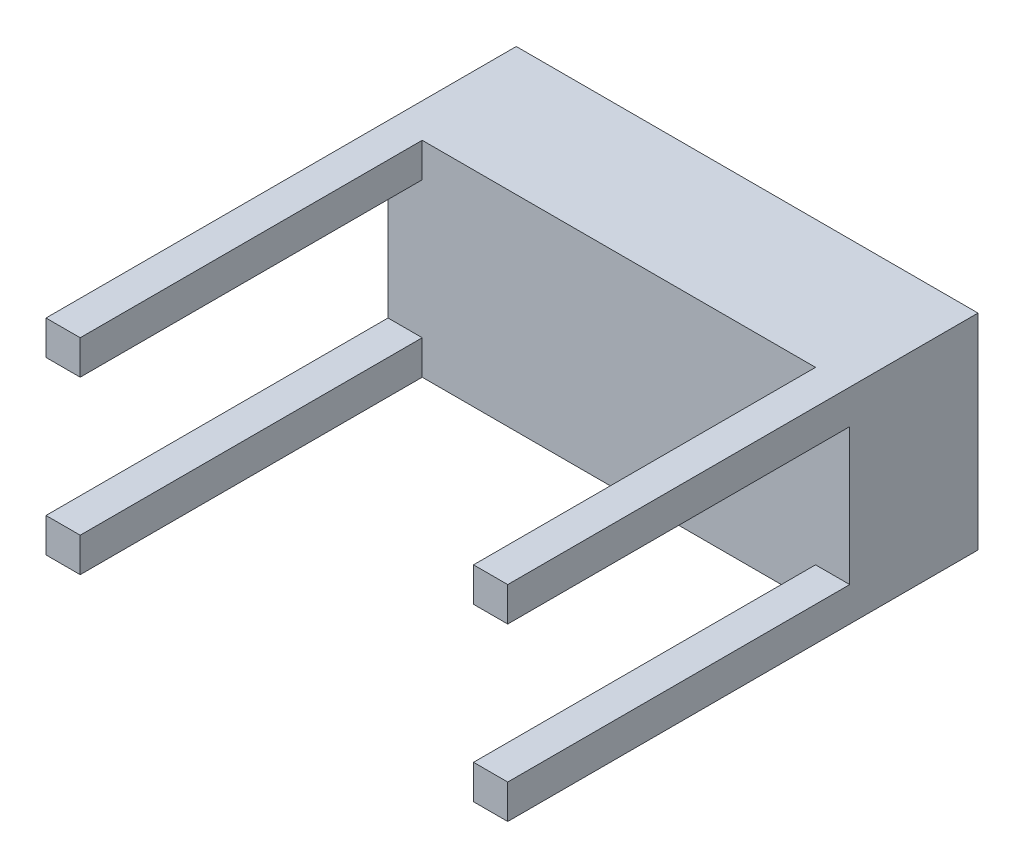
ISO-10303-21;
HEADER;
FILE_DESCRIPTION(('STEP AP214'),'2;1');
FILE_NAME('part.step','',(''),(''),'','','');
FILE_SCHEMA(('AUTOMOTIVE_DESIGN { 1 0 10303 214 1 1 1 1 }'));
ENDSEC;
DATA;
#1=APPLICATION_CONTEXT('core data for automotive mechanical design processes');
#2=APPLICATION_PROTOCOL_DEFINITION('international standard','automotive_design',2000,#1);
#3=PRODUCT_CONTEXT('',#1,'mechanical');
#4=PRODUCT('Part','Part','',(#3));
#5=PRODUCT_RELATED_PRODUCT_CATEGORY('part','',(#4));
#6=PRODUCT_DEFINITION_FORMATION('','',#4);
#7=PRODUCT_DEFINITION_CONTEXT('part definition',#1,'design');
#8=PRODUCT_DEFINITION('design','',#6,#7);
#9=PRODUCT_DEFINITION_SHAPE('','',#8);
#10=(LENGTH_UNIT() NAMED_UNIT(*) SI_UNIT(.MILLI.,.METRE.));
#11=(NAMED_UNIT(*) PLANE_ANGLE_UNIT() SI_UNIT($,.RADIAN.));
#12=(NAMED_UNIT(*) SI_UNIT($,.STERADIAN.) SOLID_ANGLE_UNIT());
#13=UNCERTAINTY_MEASURE_WITH_UNIT(LENGTH_MEASURE(1.E-05),#10,'distance_accuracy_value','');
#14=(GEOMETRIC_REPRESENTATION_CONTEXT(3) GLOBAL_UNCERTAINTY_ASSIGNED_CONTEXT((#13)) GLOBAL_UNIT_ASSIGNED_CONTEXT((#10,
#11,#12)) REPRESENTATION_CONTEXT('',''));
#15=CARTESIAN_POINT('',(0.,0.,0.));
#16=DIRECTION('',(0.,0.,1.));
#17=DIRECTION('',(1.,0.,0.));
#18=AXIS2_PLACEMENT_3D('',#15,#16,#17);
#19=CARTESIAN_POINT('',(0.,0.,150.));
#20=DIRECTION('',(0.,0.,1.));
#21=DIRECTION('',(1.,0.,0.));
#22=AXIS2_PLACEMENT_3D('',#19,#20,#21);
#23=PLANE('',#22);
#24=DIRECTION('',(1.,0.,0.));
#25=VECTOR('',#24,1.);
#26=CARTESIAN_POINT('',(0.,200.,150.));
#27=LINE('',#26,#25);
#28=CARTESIAN_POINT('',(-40.,200.,150.));
#29=VERTEX_POINT('',#28);
#30=CARTESIAN_POINT('',(0.,200.,150.));
#31=VERTEX_POINT('',#30);
#32=EDGE_CURVE('E51',#29,#31,#27,.T.);
#33=ORIENTED_EDGE('',*,*,#32,.F.);
#34=DIRECTION('',(0.,-1.,0.));
#35=VECTOR('',#34,1.);
#36=CARTESIAN_POINT('',(-40.,240.,150.));
#37=LINE('',#36,#35);
#38=CARTESIAN_POINT('',(-40.,240.,150.));
#39=VERTEX_POINT('',#38);
#40=EDGE_CURVE('E428',#39,#29,#37,.T.);
#41=ORIENTED_EDGE('',*,*,#40,.F.);
#42=DIRECTION('',(-1.,0.,0.));
#43=VECTOR('',#42,1.);
#44=CARTESIAN_POINT('',(0.,240.,150.));
#45=LINE('',#44,#43);
#46=CARTESIAN_POINT('',(-500.,240.,150.));
#47=VERTEX_POINT('',#46);
#48=EDGE_CURVE('E169',#39,#47,#45,.T.);
#49=ORIENTED_EDGE('',*,*,#48,.T.);
#50=DIRECTION('',(0.,1.,0.));
#51=VECTOR('',#50,1.);
#52=CARTESIAN_POINT('',(-500.,240.,150.));
#53=LINE('',#52,#51);
#54=CARTESIAN_POINT('',(-500.,200.,150.));
#55=VERTEX_POINT('',#54);
#56=EDGE_CURVE('E225',#55,#47,#53,.T.);
#57=ORIENTED_EDGE('',*,*,#56,.F.);
#58=DIRECTION('',(1.,0.,0.));
#59=VECTOR('',#58,1.);
#60=CARTESIAN_POINT('',(-540.,200.,150.));
#61=LINE('',#60,#59);
#62=CARTESIAN_POINT('',(-540.,200.,150.));
#63=VERTEX_POINT('',#62);
#64=EDGE_CURVE('E220',#63,#55,#61,.T.);
#65=ORIENTED_EDGE('',*,*,#64,.F.);
#66=DIRECTION('',(0.,-1.,0.));
#67=VECTOR('',#66,1.);
#68=CARTESIAN_POINT('',(-540.,0.,150.));
#69=LINE('',#68,#67);
#70=CARTESIAN_POINT('',(-540.,40.,150.));
#71=VERTEX_POINT('',#70);
#72=EDGE_CURVE('E248',#63,#71,#69,.T.);
#73=ORIENTED_EDGE('',*,*,#72,.T.);
#74=DIRECTION('',(-1.,0.,0.));
#75=VECTOR('',#74,1.);
#76=CARTESIAN_POINT('',(-540.,40.,150.));
#77=LINE('',#76,#75);
#78=CARTESIAN_POINT('',(-500.,40.,150.));
#79=VERTEX_POINT('',#78);
#80=EDGE_CURVE('E204',#79,#71,#77,.T.);
#81=ORIENTED_EDGE('',*,*,#80,.F.);
#82=DIRECTION('',(0.,1.,0.));
#83=VECTOR('',#82,1.);
#84=CARTESIAN_POINT('',(-500.,0.,150.));
#85=LINE('',#84,#83);
#86=CARTESIAN_POINT('',(-500.,0.,150.));
#87=VERTEX_POINT('',#86);
#88=EDGE_CURVE('E199',#87,#79,#85,.T.);
#89=ORIENTED_EDGE('',*,*,#88,.F.);
#90=DIRECTION('',(1.,0.,0.));
#91=VECTOR('',#90,1.);
#92=CARTESIAN_POINT('',(0.,0.,150.));
#93=LINE('',#92,#91);
#94=CARTESIAN_POINT('',(-40.,0.,150.));
#95=VERTEX_POINT('',#94);
#96=EDGE_CURVE('E251',#87,#95,#93,.T.);
#97=ORIENTED_EDGE('',*,*,#96,.T.);
#98=DIRECTION('',(0.,-1.,0.));
#99=VECTOR('',#98,1.);
#100=CARTESIAN_POINT('',(-40.,0.,150.));
#101=LINE('',#100,#99);
#102=CARTESIAN_POINT('',(-40.,40.,150.));
#103=VERTEX_POINT('',#102);
#104=EDGE_CURVE('E173',#103,#95,#101,.T.);
#105=ORIENTED_EDGE('',*,*,#104,.F.);
#106=DIRECTION('',(-1.,0.,0.));
#107=VECTOR('',#106,1.);
#108=CARTESIAN_POINT('',(0.,40.,150.));
#109=LINE('',#108,#107);
#110=CARTESIAN_POINT('',(0.,40.,150.));
#111=VERTEX_POINT('',#110);
#112=EDGE_CURVE('E170',#111,#103,#109,.T.);
#113=ORIENTED_EDGE('',*,*,#112,.F.);
#114=DIRECTION('',(0.,1.,0.));
#115=VECTOR('',#114,1.);
#116=CARTESIAN_POINT('',(0.,0.,150.));
#117=LINE('',#116,#115);
#118=EDGE_CURVE('E56',#111,#31,#117,.T.);
#119=ORIENTED_EDGE('',*,*,#118,.T.);
#120=EDGE_LOOP('',(#33,#41,#49,#57,#65,#73,#81,#89,#97,#105,#113,#119));
#121=FACE_BOUND('',#120,.T.);
#122=ADVANCED_FACE('F36',(#121),#23,.T.);
#123=CARTESIAN_POINT('',(0.,0.,150.));
#124=DIRECTION('',(-1.,0.,0.));
#125=DIRECTION('',(0.,-1.,0.));
#126=AXIS2_PLACEMENT_3D('',#123,#124,#125);
#127=PLANE('',#126);
#128=DIRECTION('',(0.,1.,0.));
#129=VECTOR('',#128,1.);
#130=CARTESIAN_POINT('',(0.,0.,0.));
#131=LINE('',#130,#129);
#132=CARTESIAN_POINT('',(0.,0.,0.));
#133=VERTEX_POINT('',#132);
#134=CARTESIAN_POINT('',(0.,240.,0.));
#135=VERTEX_POINT('',#134);
#136=EDGE_CURVE('E244',#133,#135,#131,.T.);
#137=ORIENTED_EDGE('',*,*,#136,.T.);
#138=DIRECTION('',(0.,0.,-1.));
#139=VECTOR('',#138,1.);
#140=CARTESIAN_POINT('',(0.,240.,150.));
#141=LINE('',#140,#139);
#142=CARTESIAN_POINT('',(0.,240.,550.));
#143=VERTEX_POINT('',#142);
#144=EDGE_CURVE('E11',#143,#135,#141,.T.);
#145=ORIENTED_EDGE('',*,*,#144,.F.);
#146=DIRECTION('',(0.,1.,0.));
#147=VECTOR('',#146,1.);
#148=CARTESIAN_POINT('',(0.,240.,550.));
#149=LINE('',#148,#147);
#150=CARTESIAN_POINT('',(0.,200.,550.));
#151=VERTEX_POINT('',#150);
#152=EDGE_CURVE('E164',#151,#143,#149,.T.);
#153=ORIENTED_EDGE('',*,*,#152,.F.);
#154=DIRECTION('',(0.,0.,-1.));
#155=VECTOR('',#154,1.);
#156=CARTESIAN_POINT('',(0.,200.,550.));
#157=LINE('',#156,#155);
#158=EDGE_CURVE('E175',#151,#31,#157,.T.);
#159=ORIENTED_EDGE('',*,*,#158,.T.);
#160=ORIENTED_EDGE('',*,*,#118,.F.);
#161=DIRECTION('',(0.,0.,-1.));
#162=VECTOR('',#161,1.);
#163=CARTESIAN_POINT('',(0.,40.,550.));
#164=LINE('',#163,#162);
#165=CARTESIAN_POINT('',(0.,40.,550.));
#166=VERTEX_POINT('',#165);
#167=EDGE_CURVE('E196',#166,#111,#164,.T.);
#168=ORIENTED_EDGE('',*,*,#167,.F.);
#169=DIRECTION('',(0.,1.,0.));
#170=VECTOR('',#169,1.);
#171=CARTESIAN_POINT('',(0.,0.,550.));
#172=LINE('',#171,#170);
#173=CARTESIAN_POINT('',(0.,0.,550.));
#174=VERTEX_POINT('',#173);
#175=EDGE_CURVE('E182',#174,#166,#172,.T.);
#176=ORIENTED_EDGE('',*,*,#175,.F.);
#177=DIRECTION('',(0.,0.,-1.));
#178=VECTOR('',#177,1.);
#179=CARTESIAN_POINT('',(0.,0.,150.));
#180=LINE('',#179,#178);
#181=EDGE_CURVE('E253',#174,#133,#180,.T.);
#182=ORIENTED_EDGE('',*,*,#181,.T.);
#183=EDGE_LOOP('',(#137,#145,#153,#159,#160,#168,#176,#182));
#184=FACE_BOUND('',#183,.T.);
#185=ADVANCED_FACE('F38',(#184),#127,.F.);
#186=CARTESIAN_POINT('',(0.,240.,150.));
#187=DIRECTION('',(0.,-1.,0.));
#188=DIRECTION('',(1.,0.,0.));
#189=AXIS2_PLACEMENT_3D('',#186,#187,#188);
#190=PLANE('',#189);
#191=DIRECTION('',(-1.,0.,0.));
#192=VECTOR('',#191,1.);
#193=CARTESIAN_POINT('',(0.,240.,0.));
#194=LINE('',#193,#192);
#195=CARTESIAN_POINT('',(-540.,240.,0.));
#196=VERTEX_POINT('',#195);
#197=EDGE_CURVE('E256',#135,#196,#194,.T.);
#198=ORIENTED_EDGE('',*,*,#197,.T.);
#199=DIRECTION('',(0.,0.,-1.));
#200=VECTOR('',#199,1.);
#201=CARTESIAN_POINT('',(-540.,240.,150.));
#202=LINE('',#201,#200);
#203=CARTESIAN_POINT('',(-540.,240.,550.));
#204=VERTEX_POINT('',#203);
#205=EDGE_CURVE('E44',#204,#196,#202,.T.);
#206=ORIENTED_EDGE('',*,*,#205,.F.);
#207=DIRECTION('',(-1.,0.,0.));
#208=VECTOR('',#207,1.);
#209=CARTESIAN_POINT('',(-540.,240.,550.));
#210=LINE('',#209,#208);
#211=CARTESIAN_POINT('',(-500.,240.,550.));
#212=VERTEX_POINT('',#211);
#213=EDGE_CURVE('E229',#212,#204,#210,.T.);
#214=ORIENTED_EDGE('',*,*,#213,.F.);
#215=DIRECTION('',(0.,0.,-1.));
#216=VECTOR('',#215,1.);
#217=CARTESIAN_POINT('',(-500.,240.,550.));
#218=LINE('',#217,#216);
#219=EDGE_CURVE('E232',#212,#47,#218,.T.);
#220=ORIENTED_EDGE('',*,*,#219,.T.);
#221=ORIENTED_EDGE('',*,*,#48,.F.);
#222=DIRECTION('',(0.,0.,-1.));
#223=VECTOR('',#222,1.);
#224=CARTESIAN_POINT('',(-40.,240.,550.));
#225=LINE('',#224,#223);
#226=CARTESIAN_POINT('',(-40.,240.,550.));
#227=VERTEX_POINT('',#226);
#228=EDGE_CURVE('E152',#227,#39,#225,.T.);
#229=ORIENTED_EDGE('',*,*,#228,.F.);
#230=DIRECTION('',(-1.,0.,0.));
#231=VECTOR('',#230,1.);
#232=CARTESIAN_POINT('',(0.,240.,550.));
#233=LINE('',#232,#231);
#234=EDGE_CURVE('E158',#143,#227,#233,.T.);
#235=ORIENTED_EDGE('',*,*,#234,.F.);
#236=ORIENTED_EDGE('',*,*,#144,.T.);
#237=EDGE_LOOP('',(#198,#206,#214,#220,#221,#229,#235,#236));
#238=FACE_BOUND('',#237,.T.);
#239=ADVANCED_FACE('F167',(#238),#190,.F.);
#240=CARTESIAN_POINT('',(-540.,0.,150.));
#241=DIRECTION('',(1.,0.,0.));
#242=DIRECTION('',(0.,0.,-1.));
#243=AXIS2_PLACEMENT_3D('',#240,#241,#242);
#244=PLANE('',#243);
#245=DIRECTION('',(0.,-1.,0.));
#246=VECTOR('',#245,1.);
#247=CARTESIAN_POINT('',(-540.,0.,0.));
#248=LINE('',#247,#246);
#249=CARTESIAN_POINT('',(-540.,0.,0.));
#250=VERTEX_POINT('',#249);
#251=EDGE_CURVE('E258',#196,#250,#248,.T.);
#252=ORIENTED_EDGE('',*,*,#251,.T.);
#253=DIRECTION('',(0.,0.,-1.));
#254=VECTOR('',#253,1.);
#255=CARTESIAN_POINT('',(-540.,0.,150.));
#256=LINE('',#255,#254);
#257=CARTESIAN_POINT('',(-540.,0.,550.));
#258=VERTEX_POINT('',#257);
#259=EDGE_CURVE('E263',#258,#250,#256,.T.);
#260=ORIENTED_EDGE('',*,*,#259,.F.);
#261=DIRECTION('',(0.,-1.,0.));
#262=VECTOR('',#261,1.);
#263=CARTESIAN_POINT('',(-540.,0.,550.));
#264=LINE('',#263,#262);
#265=CARTESIAN_POINT('',(-540.,40.,550.));
#266=VERTEX_POINT('',#265);
#267=EDGE_CURVE('E200',#266,#258,#264,.T.);
#268=ORIENTED_EDGE('',*,*,#267,.F.);
#269=DIRECTION('',(0.,0.,-1.));
#270=VECTOR('',#269,1.);
#271=CARTESIAN_POINT('',(-540.,40.,550.));
#272=LINE('',#271,#270);
#273=EDGE_CURVE('E210',#266,#71,#272,.T.);
#274=ORIENTED_EDGE('',*,*,#273,.T.);
#275=ORIENTED_EDGE('',*,*,#72,.F.);
#276=DIRECTION('',(0.,0.,-1.));
#277=VECTOR('',#276,1.);
#278=CARTESIAN_POINT('',(-540.,200.,550.));
#279=LINE('',#278,#277);
#280=CARTESIAN_POINT('',(-540.,200.,550.));
#281=VERTEX_POINT('',#280);
#282=EDGE_CURVE('E241',#281,#63,#279,.T.);
#283=ORIENTED_EDGE('',*,*,#282,.F.);
#284=DIRECTION('',(0.,-1.,0.));
#285=VECTOR('',#284,1.);
#286=CARTESIAN_POINT('',(-540.,240.,550.));
#287=LINE('',#286,#285);
#288=EDGE_CURVE('E221',#204,#281,#287,.T.);
#289=ORIENTED_EDGE('',*,*,#288,.F.);
#290=ORIENTED_EDGE('',*,*,#205,.T.);
#291=EDGE_LOOP('',(#252,#260,#268,#274,#275,#283,#289,#290));
#292=FACE_BOUND('',#291,.T.);
#293=ADVANCED_FACE('F269',(#292),#244,.F.);
#294=CARTESIAN_POINT('',(0.,0.,150.));
#295=DIRECTION('',(0.,1.,0.));
#296=DIRECTION('',(0.,0.,1.));
#297=AXIS2_PLACEMENT_3D('',#294,#295,#296);
#298=PLANE('',#297);
#299=DIRECTION('',(1.,0.,0.));
#300=VECTOR('',#299,1.);
#301=CARTESIAN_POINT('',(0.,0.,0.));
#302=LINE('',#301,#300);
#303=EDGE_CURVE('E246',#250,#133,#302,.T.);
#304=ORIENTED_EDGE('',*,*,#303,.T.);
#305=ORIENTED_EDGE('',*,*,#181,.F.);
#306=DIRECTION('',(1.,0.,0.));
#307=VECTOR('',#306,1.);
#308=CARTESIAN_POINT('',(0.,0.,550.));
#309=LINE('',#308,#307);
#310=CARTESIAN_POINT('',(-40.,0.,550.));
#311=VERTEX_POINT('',#310);
#312=EDGE_CURVE('E179',#311,#174,#309,.T.);
#313=ORIENTED_EDGE('',*,*,#312,.F.);
#314=DIRECTION('',(0.,0.,-1.));
#315=VECTOR('',#314,1.);
#316=CARTESIAN_POINT('',(-40.,0.,550.));
#317=LINE('',#316,#315);
#318=EDGE_CURVE('E187',#311,#95,#317,.T.);
#319=ORIENTED_EDGE('',*,*,#318,.T.);
#320=ORIENTED_EDGE('',*,*,#96,.F.);
#321=DIRECTION('',(0.,0.,-1.));
#322=VECTOR('',#321,1.);
#323=CARTESIAN_POINT('',(-500.,0.,550.));
#324=LINE('',#323,#322);
#325=CARTESIAN_POINT('',(-500.,0.,550.));
#326=VERTEX_POINT('',#325);
#327=EDGE_CURVE('E218',#326,#87,#324,.T.);
#328=ORIENTED_EDGE('',*,*,#327,.F.);
#329=DIRECTION('',(1.,0.,0.));
#330=VECTOR('',#329,1.);
#331=CARTESIAN_POINT('',(-540.,0.,550.));
#332=LINE('',#331,#330);
#333=EDGE_CURVE('E203',#258,#326,#332,.T.);
#334=ORIENTED_EDGE('',*,*,#333,.F.);
#335=ORIENTED_EDGE('',*,*,#259,.T.);
#336=EDGE_LOOP('',(#304,#305,#313,#319,#320,#328,#334,#335));
#337=FACE_BOUND('',#336,.T.);
#338=ADVANCED_FACE('F277',(#337),#298,.F.);
#339=CARTESIAN_POINT('',(0.,0.,0.));
#340=DIRECTION('',(0.,0.,1.));
#341=DIRECTION('',(1.,0.,0.));
#342=AXIS2_PLACEMENT_3D('',#339,#340,#341);
#343=PLANE('',#342);
#344=ORIENTED_EDGE('',*,*,#136,.F.);
#345=ORIENTED_EDGE('',*,*,#303,.F.);
#346=ORIENTED_EDGE('',*,*,#251,.F.);
#347=ORIENTED_EDGE('',*,*,#197,.F.);
#348=EDGE_LOOP('',(#344,#345,#346,#347));
#349=FACE_BOUND('',#348,.T.);
#350=ADVANCED_FACE('F275',(#349),#343,.F.);
#351=CARTESIAN_POINT('',(-540.,200.,550.));
#352=DIRECTION('',(0.,1.,0.));
#353=DIRECTION('',(-1.,0.,0.));
#354=AXIS2_PLACEMENT_3D('',#351,#352,#353);
#355=PLANE('',#354);
#356=ORIENTED_EDGE('',*,*,#64,.T.);
#357=DIRECTION('',(0.,0.,-1.));
#358=VECTOR('',#357,1.);
#359=CARTESIAN_POINT('',(-500.,200.,550.));
#360=LINE('',#359,#358);
#361=CARTESIAN_POINT('',(-500.,200.,550.));
#362=VERTEX_POINT('',#361);
#363=EDGE_CURVE('E238',#362,#55,#360,.T.);
#364=ORIENTED_EDGE('',*,*,#363,.F.);
#365=DIRECTION('',(1.,0.,0.));
#366=VECTOR('',#365,1.);
#367=CARTESIAN_POINT('',(-540.,200.,550.));
#368=LINE('',#367,#366);
#369=EDGE_CURVE('E224',#281,#362,#368,.T.);
#370=ORIENTED_EDGE('',*,*,#369,.F.);
#371=ORIENTED_EDGE('',*,*,#282,.T.);
#372=EDGE_LOOP('',(#356,#364,#370,#371));
#373=FACE_BOUND('',#372,.T.);
#374=ADVANCED_FACE('F314',(#373),#355,.F.);
#375=CARTESIAN_POINT('',(-500.,240.,550.));
#376=DIRECTION('',(-1.,0.,0.));
#377=DIRECTION('',(0.,0.,1.));
#378=AXIS2_PLACEMENT_3D('',#375,#376,#377);
#379=PLANE('',#378);
#380=ORIENTED_EDGE('',*,*,#56,.T.);
#381=ORIENTED_EDGE('',*,*,#219,.F.);
#382=DIRECTION('',(0.,1.,0.));
#383=VECTOR('',#382,1.);
#384=CARTESIAN_POINT('',(-500.,240.,550.));
#385=LINE('',#384,#383);
#386=EDGE_CURVE('E227',#362,#212,#385,.T.);
#387=ORIENTED_EDGE('',*,*,#386,.F.);
#388=ORIENTED_EDGE('',*,*,#363,.T.);
#389=EDGE_LOOP('',(#380,#381,#387,#388));
#390=FACE_BOUND('',#389,.T.);
#391=ADVANCED_FACE('F344',(#390),#379,.F.);
#392=CARTESIAN_POINT('',(0.,0.,550.));
#393=DIRECTION('',(0.,0.,1.));
#394=DIRECTION('',(1.,0.,0.));
#395=AXIS2_PLACEMENT_3D('',#392,#393,#394);
#396=PLANE('',#395);
#397=ORIENTED_EDGE('',*,*,#288,.T.);
#398=ORIENTED_EDGE('',*,*,#369,.T.);
#399=ORIENTED_EDGE('',*,*,#386,.T.);
#400=ORIENTED_EDGE('',*,*,#213,.T.);
#401=EDGE_LOOP('',(#397,#398,#399,#400));
#402=FACE_BOUND('',#401,.T.);
#403=ADVANCED_FACE('F351',(#402),#396,.T.);
#404=CARTESIAN_POINT('',(-500.,0.,550.));
#405=DIRECTION('',(-1.,0.,0.));
#406=DIRECTION('',(0.,0.,1.));
#407=AXIS2_PLACEMENT_3D('',#404,#405,#406);
#408=PLANE('',#407);
#409=ORIENTED_EDGE('',*,*,#88,.T.);
#410=DIRECTION('',(0.,0.,-1.));
#411=VECTOR('',#410,1.);
#412=CARTESIAN_POINT('',(-500.,40.,550.));
#413=LINE('',#412,#411);
#414=CARTESIAN_POINT('',(-500.,40.,550.));
#415=VERTEX_POINT('',#414);
#416=EDGE_CURVE('E216',#415,#79,#413,.T.);
#417=ORIENTED_EDGE('',*,*,#416,.F.);
#418=DIRECTION('',(0.,1.,0.));
#419=VECTOR('',#418,1.);
#420=CARTESIAN_POINT('',(-500.,0.,550.));
#421=LINE('',#420,#419);
#422=EDGE_CURVE('E206',#326,#415,#421,.T.);
#423=ORIENTED_EDGE('',*,*,#422,.F.);
#424=ORIENTED_EDGE('',*,*,#327,.T.);
#425=EDGE_LOOP('',(#409,#417,#423,#424));
#426=FACE_BOUND('',#425,.T.);
#427=ADVANCED_FACE('F358',(#426),#408,.F.);
#428=CARTESIAN_POINT('',(-540.,40.,550.));
#429=DIRECTION('',(0.,-1.,0.));
#430=DIRECTION('',(0.,0.,-1.));
#431=AXIS2_PLACEMENT_3D('',#428,#429,#430);
#432=PLANE('',#431);
#433=ORIENTED_EDGE('',*,*,#80,.T.);
#434=ORIENTED_EDGE('',*,*,#273,.F.);
#435=DIRECTION('',(-1.,0.,0.));
#436=VECTOR('',#435,1.);
#437=CARTESIAN_POINT('',(-540.,40.,550.));
#438=LINE('',#437,#436);
#439=EDGE_CURVE('E208',#415,#266,#438,.T.);
#440=ORIENTED_EDGE('',*,*,#439,.F.);
#441=ORIENTED_EDGE('',*,*,#416,.T.);
#442=EDGE_LOOP('',(#433,#434,#440,#441));
#443=FACE_BOUND('',#442,.T.);
#444=ADVANCED_FACE('F304',(#443),#432,.F.);
#445=CARTESIAN_POINT('',(0.,0.,550.));
#446=DIRECTION('',(0.,0.,-1.));
#447=DIRECTION('',(-1.,0.,0.));
#448=AXIS2_PLACEMENT_3D('',#445,#446,#447);
#449=PLANE('',#448);
#450=ORIENTED_EDGE('',*,*,#267,.T.);
#451=ORIENTED_EDGE('',*,*,#333,.T.);
#452=ORIENTED_EDGE('',*,*,#422,.T.);
#453=ORIENTED_EDGE('',*,*,#439,.T.);
#454=EDGE_LOOP('',(#450,#451,#452,#453));
#455=FACE_BOUND('',#454,.T.);
#456=ADVANCED_FACE('F297',(#455),#449,.F.);
#457=CARTESIAN_POINT('',(0.,40.,550.));
#458=DIRECTION('',(0.,-1.,0.));
#459=DIRECTION('',(0.,0.,-1.));
#460=AXIS2_PLACEMENT_3D('',#457,#458,#459);
#461=PLANE('',#460);
#462=ORIENTED_EDGE('',*,*,#112,.T.);
#463=DIRECTION('',(0.,0.,-1.));
#464=VECTOR('',#463,1.);
#465=CARTESIAN_POINT('',(-40.,40.,550.));
#466=LINE('',#465,#464);
#467=CARTESIAN_POINT('',(-40.,40.,550.));
#468=VERTEX_POINT('',#467);
#469=EDGE_CURVE('E193',#468,#103,#466,.T.);
#470=ORIENTED_EDGE('',*,*,#469,.F.);
#471=DIRECTION('',(-1.,0.,0.));
#472=VECTOR('',#471,1.);
#473=CARTESIAN_POINT('',(0.,40.,550.));
#474=LINE('',#473,#472);
#475=EDGE_CURVE('E184',#166,#468,#474,.T.);
#476=ORIENTED_EDGE('',*,*,#475,.F.);
#477=ORIENTED_EDGE('',*,*,#167,.T.);
#478=EDGE_LOOP('',(#462,#470,#476,#477));
#479=FACE_BOUND('',#478,.T.);
#480=ADVANCED_FACE('F295',(#479),#461,.F.);
#481=CARTESIAN_POINT('',(-40.,0.,550.));
#482=DIRECTION('',(1.,0.,0.));
#483=DIRECTION('',(0.,0.,-1.));
#484=AXIS2_PLACEMENT_3D('',#481,#482,#483);
#485=PLANE('',#484);
#486=ORIENTED_EDGE('',*,*,#104,.T.);
#487=ORIENTED_EDGE('',*,*,#318,.F.);
#488=DIRECTION('',(0.,-1.,0.));
#489=VECTOR('',#488,1.);
#490=CARTESIAN_POINT('',(-40.,0.,550.));
#491=LINE('',#490,#489);
#492=EDGE_CURVE('E186',#468,#311,#491,.T.);
#493=ORIENTED_EDGE('',*,*,#492,.F.);
#494=ORIENTED_EDGE('',*,*,#469,.T.);
#495=EDGE_LOOP('',(#486,#487,#493,#494));
#496=FACE_BOUND('',#495,.T.);
#497=ADVANCED_FACE('F291',(#496),#485,.F.);
#498=CARTESIAN_POINT('',(0.,0.,550.));
#499=DIRECTION('',(0.,0.,-1.));
#500=DIRECTION('',(-1.,0.,0.));
#501=AXIS2_PLACEMENT_3D('',#498,#499,#500);
#502=PLANE('',#501);
#503=ORIENTED_EDGE('',*,*,#312,.T.);
#504=ORIENTED_EDGE('',*,*,#175,.T.);
#505=ORIENTED_EDGE('',*,*,#475,.T.);
#506=ORIENTED_EDGE('',*,*,#492,.T.);
#507=EDGE_LOOP('',(#503,#504,#505,#506));
#508=FACE_BOUND('',#507,.T.);
#509=ADVANCED_FACE('F285',(#508),#502,.F.);
#510=CARTESIAN_POINT('',(-40.,240.,550.));
#511=DIRECTION('',(1.,0.,0.));
#512=DIRECTION('',(0.,1.,0.));
#513=AXIS2_PLACEMENT_3D('',#510,#511,#512);
#514=PLANE('',#513);
#515=ORIENTED_EDGE('',*,*,#40,.T.);
#516=DIRECTION('',(0.,0.,-1.));
#517=VECTOR('',#516,1.);
#518=CARTESIAN_POINT('',(-40.,200.,550.));
#519=LINE('',#518,#517);
#520=CARTESIAN_POINT('',(-40.,200.,550.));
#521=VERTEX_POINT('',#520);
#522=EDGE_CURVE('E154',#521,#29,#519,.T.);
#523=ORIENTED_EDGE('',*,*,#522,.F.);
#524=DIRECTION('',(0.,-1.,0.));
#525=VECTOR('',#524,1.);
#526=CARTESIAN_POINT('',(-40.,240.,550.));
#527=LINE('',#526,#525);
#528=EDGE_CURVE('E148',#227,#521,#527,.T.);
#529=ORIENTED_EDGE('',*,*,#528,.F.);
#530=ORIENTED_EDGE('',*,*,#228,.T.);
#531=EDGE_LOOP('',(#515,#523,#529,#530));
#532=FACE_BOUND('',#531,.T.);
#533=ADVANCED_FACE('F150',(#532),#514,.F.);
#534=CARTESIAN_POINT('',(0.,200.,550.));
#535=DIRECTION('',(0.,1.,0.));
#536=DIRECTION('',(-1.,0.,0.));
#537=AXIS2_PLACEMENT_3D('',#534,#535,#536);
#538=PLANE('',#537);
#539=ORIENTED_EDGE('',*,*,#32,.T.);
#540=ORIENTED_EDGE('',*,*,#158,.F.);
#541=DIRECTION('',(1.,0.,0.));
#542=VECTOR('',#541,1.);
#543=CARTESIAN_POINT('',(0.,200.,550.));
#544=LINE('',#543,#542);
#545=EDGE_CURVE('E157',#521,#151,#544,.T.);
#546=ORIENTED_EDGE('',*,*,#545,.F.);
#547=ORIENTED_EDGE('',*,*,#522,.T.);
#548=EDGE_LOOP('',(#539,#540,#546,#547));
#549=FACE_BOUND('',#548,.T.);
#550=ADVANCED_FACE('F405',(#549),#538,.F.);
#551=CARTESIAN_POINT('',(0.,0.,550.));
#552=DIRECTION('',(0.,0.,1.));
#553=DIRECTION('',(1.,0.,0.));
#554=AXIS2_PLACEMENT_3D('',#551,#552,#553);
#555=PLANE('',#554);
#556=ORIENTED_EDGE('',*,*,#234,.T.);
#557=ORIENTED_EDGE('',*,*,#528,.T.);
#558=ORIENTED_EDGE('',*,*,#545,.T.);
#559=ORIENTED_EDGE('',*,*,#152,.T.);
#560=EDGE_LOOP('',(#556,#557,#558,#559));
#561=FACE_BOUND('',#560,.T.);
#562=ADVANCED_FACE('F162',(#561),#555,.T.);
#563=CLOSED_SHELL('',(#122,#185,#239,#293,#338,#350,#374,#391,#403,#427,#444,#456,#480,#497,
#509,#533,#550,#562));
#564=MANIFOLD_SOLID_BREP('B2',#563);
#565=ADVANCED_BREP_SHAPE_REPRESENTATION('',(#18,#564),#14);
#566=SHAPE_DEFINITION_REPRESENTATION(#9,#565);
ENDSEC;
END-ISO-10303-21;
